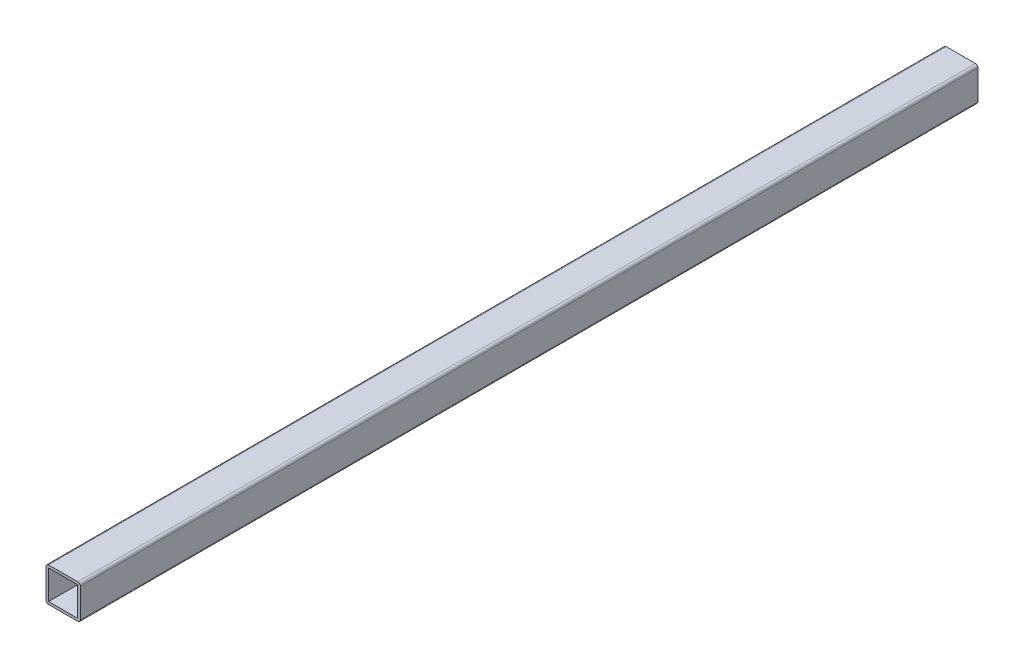
ISO-10303-21;
HEADER;
FILE_DESCRIPTION(('STEP AP214'),'2;1');
FILE_NAME('part.step','',(''),(''),'','','');
FILE_SCHEMA(('AUTOMOTIVE_DESIGN { 1 0 10303 214 1 1 1 1 }'));
ENDSEC;
DATA;
#1=APPLICATION_CONTEXT('core data for automotive mechanical design processes');
#2=APPLICATION_PROTOCOL_DEFINITION('international standard','automotive_design',2000,#1);
#3=PRODUCT_CONTEXT('',#1,'mechanical');
#4=PRODUCT('Part','Part','',(#3));
#5=PRODUCT_RELATED_PRODUCT_CATEGORY('part','',(#4));
#6=PRODUCT_DEFINITION_FORMATION('','',#4);
#7=PRODUCT_DEFINITION_CONTEXT('part definition',#1,'design');
#8=PRODUCT_DEFINITION('design','',#6,#7);
#9=PRODUCT_DEFINITION_SHAPE('','',#8);
#10=(LENGTH_UNIT() NAMED_UNIT(*) SI_UNIT(.MILLI.,.METRE.));
#11=(NAMED_UNIT(*) PLANE_ANGLE_UNIT() SI_UNIT($,.RADIAN.));
#12=(NAMED_UNIT(*) SI_UNIT($,.STERADIAN.) SOLID_ANGLE_UNIT());
#13=UNCERTAINTY_MEASURE_WITH_UNIT(LENGTH_MEASURE(1.E-05),#10,'distance_accuracy_value','');
#14=(GEOMETRIC_REPRESENTATION_CONTEXT(3) GLOBAL_UNCERTAINTY_ASSIGNED_CONTEXT((#13)) GLOBAL_UNIT_ASSIGNED_CONTEXT((#10,
#11,#12)) REPRESENTATION_CONTEXT('',''));
#15=CARTESIAN_POINT('',(0.,0.,0.));
#16=DIRECTION('',(0.,0.,1.));
#17=DIRECTION('',(1.,0.,0.));
#18=AXIS2_PLACEMENT_3D('',#15,#16,#17);
#19=CARTESIAN_POINT('',(-609.999999999993,609.999999999999,1103.56854249492));
#20=DIRECTION('',(1.,0.,0.));
#21=DIRECTION('',(0.,0.,-1.));
#22=AXIS2_PLACEMENT_3D('',#19,#20,#21);
#23=PLANE('',#22);
#24=DIRECTION('',(0.,-1.,0.));
#25=VECTOR('',#24,1.);
#26=CARTESIAN_POINT('',(-609.999999999993,609.999999999999,0.));
#27=LINE('',#26,#25);
#28=CARTESIAN_POINT('',(-609.999999999993,606.999999999999,0.));
#29=VERTEX_POINT('',#28);
#30=CARTESIAN_POINT('',(-609.999999999993,572.999999999999,0.));
#31=VERTEX_POINT('',#30);
#32=EDGE_CURVE('E185',#29,#31,#27,.T.);
#33=ORIENTED_EDGE('',*,*,#32,.T.);
#34=DIRECTION('',(0.,0.,-1.));
#35=VECTOR('',#34,1.);
#36=CARTESIAN_POINT('',(-609.999999999993,572.999999999999,1103.56854249492));
#37=LINE('',#36,#35);
#38=CARTESIAN_POINT('',(-609.999999999993,572.999999999999,1047.));
#39=VERTEX_POINT('',#38);
#40=EDGE_CURVE('E11',#31,#39,#37,.F.);
#41=ORIENTED_EDGE('',*,*,#40,.T.);
#42=DIRECTION('',(0.,-1.,0.));
#43=VECTOR('',#42,1.);
#44=CARTESIAN_POINT('',(-609.999999999993,609.999999999999,1047.));
#45=LINE('',#44,#43);
#46=CARTESIAN_POINT('',(-609.999999999993,606.999999999999,1047.));
#47=VERTEX_POINT('',#46);
#48=EDGE_CURVE('E166',#47,#39,#45,.T.);
#49=ORIENTED_EDGE('',*,*,#48,.F.);
#50=DIRECTION('',(0.,0.,-1.));
#51=VECTOR('',#50,1.);
#52=CARTESIAN_POINT('',(-609.999999999993,606.999999999999,1103.56854249492));
#53=LINE('',#52,#51);
#54=EDGE_CURVE('E46',#47,#29,#53,.T.);
#55=ORIENTED_EDGE('',*,*,#54,.T.);
#56=EDGE_LOOP('',(#33,#41,#49,#55));
#57=FACE_BOUND('',#56,.T.);
#58=ADVANCED_FACE('F37',(#57),#23,.F.);
#59=CARTESIAN_POINT('',(-609.999999999993,569.999999999999,1103.56854249492));
#60=DIRECTION('',(0.,1.,0.));
#61=DIRECTION('',(0.,0.,1.));
#62=AXIS2_PLACEMENT_3D('',#59,#60,#61);
#63=PLANE('',#62);
#64=DIRECTION('',(1.,0.,0.));
#65=VECTOR('',#64,1.);
#66=CARTESIAN_POINT('',(-609.999999999993,569.999999999999,0.));
#67=LINE('',#66,#65);
#68=CARTESIAN_POINT('',(-606.999999999993,569.999999999999,0.));
#69=VERTEX_POINT('',#68);
#70=CARTESIAN_POINT('',(-572.999999999999,569.999999999999,0.));
#71=VERTEX_POINT('',#70);
#72=EDGE_CURVE('E181',#69,#71,#67,.T.);
#73=ORIENTED_EDGE('',*,*,#72,.T.);
#74=DIRECTION('',(0.,0.,-1.));
#75=VECTOR('',#74,1.);
#76=CARTESIAN_POINT('',(-572.999999999999,569.999999999999,1103.56854249492));
#77=LINE('',#76,#75);
#78=CARTESIAN_POINT('',(-572.999999999999,569.999999999999,1047.));
#79=VERTEX_POINT('',#78);
#80=EDGE_CURVE('E222',#71,#79,#77,.F.);
#81=ORIENTED_EDGE('',*,*,#80,.T.);
#82=DIRECTION('',(1.,0.,0.));
#83=VECTOR('',#82,1.);
#84=CARTESIAN_POINT('',(-609.999999999993,569.999999999999,1047.));
#85=LINE('',#84,#83);
#86=CARTESIAN_POINT('',(-606.999999999993,569.999999999999,1047.));
#87=VERTEX_POINT('',#86);
#88=EDGE_CURVE('E176',#87,#79,#85,.T.);
#89=ORIENTED_EDGE('',*,*,#88,.F.);
#90=DIRECTION('',(0.,0.,-1.));
#91=VECTOR('',#90,1.);
#92=CARTESIAN_POINT('',(-606.999999999993,569.999999999999,1103.56854249492));
#93=LINE('',#92,#91);
#94=EDGE_CURVE('E218',#87,#69,#93,.T.);
#95=ORIENTED_EDGE('',*,*,#94,.T.);
#96=EDGE_LOOP('',(#73,#81,#89,#95));
#97=FACE_BOUND('',#96,.T.);
#98=ADVANCED_FACE('F261',(#97),#63,.F.);
#99=CARTESIAN_POINT('',(-569.999999999999,609.999999999999,1103.56854249492));
#100=DIRECTION('',(-1.,0.,0.));
#101=DIRECTION('',(0.,0.,1.));
#102=AXIS2_PLACEMENT_3D('',#99,#100,#101);
#103=PLANE('',#102);
#104=DIRECTION('',(0.,1.,0.));
#105=VECTOR('',#104,1.);
#106=CARTESIAN_POINT('',(-569.999999999999,609.999999999999,1047.));
#107=LINE('',#106,#105);
#108=CARTESIAN_POINT('',(-569.999999999999,572.999999999999,1047.));
#109=VERTEX_POINT('',#108);
#110=CARTESIAN_POINT('',(-569.999999999999,606.999999999999,1047.));
#111=VERTEX_POINT('',#110);
#112=EDGE_CURVE('E193',#109,#111,#107,.T.);
#113=ORIENTED_EDGE('',*,*,#112,.F.);
#114=DIRECTION('',(0.,0.,-1.));
#115=VECTOR('',#114,1.);
#116=CARTESIAN_POINT('',(-569.999999999999,572.999999999999,1103.56854249492));
#117=LINE('',#116,#115);
#118=CARTESIAN_POINT('',(-569.999999999999,572.999999999999,0.));
#119=VERTEX_POINT('',#118);
#120=EDGE_CURVE('E202',#109,#119,#117,.T.);
#121=ORIENTED_EDGE('',*,*,#120,.T.);
#122=DIRECTION('',(0.,1.,0.));
#123=VECTOR('',#122,1.);
#124=CARTESIAN_POINT('',(-569.999999999999,609.999999999999,0.));
#125=LINE('',#124,#123);
#126=CARTESIAN_POINT('',(-569.999999999999,606.999999999999,0.));
#127=VERTEX_POINT('',#126);
#128=EDGE_CURVE('E177',#119,#127,#125,.T.);
#129=ORIENTED_EDGE('',*,*,#128,.T.);
#130=DIRECTION('',(0.,0.,-1.));
#131=VECTOR('',#130,1.);
#132=CARTESIAN_POINT('',(-569.999999999999,606.999999999999,1103.56854249492));
#133=LINE('',#132,#131);
#134=EDGE_CURVE('E170',#127,#111,#133,.F.);
#135=ORIENTED_EDGE('',*,*,#134,.T.);
#136=EDGE_LOOP('',(#113,#121,#129,#135));
#137=FACE_BOUND('',#136,.T.);
#138=ADVANCED_FACE('F271',(#137),#103,.F.);
#139=CARTESIAN_POINT('',(-609.999999999993,609.999999999999,1103.56854249492));
#140=DIRECTION('',(0.,-1.,0.));
#141=DIRECTION('',(0.,0.,-1.));
#142=AXIS2_PLACEMENT_3D('',#139,#140,#141);
#143=PLANE('',#142);
#144=DIRECTION('',(-1.,0.,0.));
#145=VECTOR('',#144,1.);
#146=CARTESIAN_POINT('',(-609.999999999993,609.999999999999,1047.));
#147=LINE('',#146,#145);
#148=CARTESIAN_POINT('',(-572.999999999999,609.999999999999,1047.));
#149=VERTEX_POINT('',#148);
#150=CARTESIAN_POINT('',(-606.999999999993,609.999999999999,1047.));
#151=VERTEX_POINT('',#150);
#152=EDGE_CURVE('E171',#149,#151,#147,.T.);
#153=ORIENTED_EDGE('',*,*,#152,.F.);
#154=DIRECTION('',(0.,0.,-1.));
#155=VECTOR('',#154,1.);
#156=CARTESIAN_POINT('',(-572.999999999999,609.999999999999,1103.56854249492));
#157=LINE('',#156,#155);
#158=CARTESIAN_POINT('',(-572.999999999999,609.999999999999,0.));
#159=VERTEX_POINT('',#158);
#160=EDGE_CURVE('E240',#149,#159,#157,.T.);
#161=ORIENTED_EDGE('',*,*,#160,.T.);
#162=DIRECTION('',(-1.,0.,0.));
#163=VECTOR('',#162,1.);
#164=CARTESIAN_POINT('',(-609.999999999993,609.999999999999,0.));
#165=LINE('',#164,#163);
#166=CARTESIAN_POINT('',(-606.999999999993,609.999999999999,0.));
#167=VERTEX_POINT('',#166);
#168=EDGE_CURVE('E172',#159,#167,#165,.T.);
#169=ORIENTED_EDGE('',*,*,#168,.T.);
#170=DIRECTION('',(0.,0.,-1.));
#171=VECTOR('',#170,1.);
#172=CARTESIAN_POINT('',(-606.999999999993,609.999999999999,1103.56854249492));
#173=LINE('',#172,#171);
#174=EDGE_CURVE('E237',#167,#151,#173,.F.);
#175=ORIENTED_EDGE('',*,*,#174,.T.);
#176=EDGE_LOOP('',(#153,#161,#169,#175));
#177=FACE_BOUND('',#176,.T.);
#178=ADVANCED_FACE('F279',(#177),#143,.F.);
#179=CARTESIAN_POINT('',(0.,0.,0.));
#180=DIRECTION('',(0.,0.,1.));
#181=DIRECTION('',(1.,0.,0.));
#182=AXIS2_PLACEMENT_3D('',#179,#180,#181);
#183=PLANE('',#182);
#184=DIRECTION('',(1.,0.,0.));
#185=VECTOR('',#184,1.);
#186=CARTESIAN_POINT('',(-609.999999999993,572.999999999999,0.));
#187=LINE('',#186,#185);
#188=CARTESIAN_POINT('',(-606.999999999993,572.999999999999,0.));
#189=VERTEX_POINT('',#188);
#190=CARTESIAN_POINT('',(-572.999999999999,572.999999999999,0.));
#191=VERTEX_POINT('',#190);
#192=EDGE_CURVE('E149',#189,#191,#187,.T.);
#193=ORIENTED_EDGE('',*,*,#192,.T.);
#194=DIRECTION('',(0.,1.,0.));
#195=VECTOR('',#194,1.);
#196=CARTESIAN_POINT('',(-572.999999999999,609.999999999999,0.));
#197=LINE('',#196,#195);
#198=CARTESIAN_POINT('',(-572.999999999999,606.999999999999,0.));
#199=VERTEX_POINT('',#198);
#200=EDGE_CURVE('E130',#191,#199,#197,.T.);
#201=ORIENTED_EDGE('',*,*,#200,.T.);
#202=DIRECTION('',(-1.,0.,0.));
#203=VECTOR('',#202,1.);
#204=CARTESIAN_POINT('',(-609.999999999993,606.999999999999,0.));
#205=LINE('',#204,#203);
#206=CARTESIAN_POINT('',(-606.999999999993,606.999999999999,0.));
#207=VERTEX_POINT('',#206);
#208=EDGE_CURVE('E139',#199,#207,#205,.T.);
#209=ORIENTED_EDGE('',*,*,#208,.T.);
#210=DIRECTION('',(0.,-1.,0.));
#211=VECTOR('',#210,1.);
#212=CARTESIAN_POINT('',(-606.999999999993,609.999999999999,0.));
#213=LINE('',#212,#211);
#214=EDGE_CURVE('E53',#207,#189,#213,.T.);
#215=ORIENTED_EDGE('',*,*,#214,.T.);
#216=EDGE_LOOP('',(#193,#201,#209,#215));
#217=FACE_BOUND('',#216,.T.);
#218=ORIENTED_EDGE('',*,*,#128,.F.);
#219=CARTESIAN_POINT('',(-572.999999999999,572.999999999999,0.));
#220=DIRECTION('',(0.,0.,1.));
#221=DIRECTION('',(1.,0.,0.));
#222=AXIS2_PLACEMENT_3D('',#219,#220,#221);
#223=CIRCLE('',#222,3.);
#224=EDGE_CURVE('E215',#119,#71,#223,.F.);
#225=ORIENTED_EDGE('',*,*,#224,.T.);
#226=ORIENTED_EDGE('',*,*,#72,.F.);
#227=CARTESIAN_POINT('',(-606.999999999993,572.999999999999,0.));
#228=DIRECTION('',(0.,0.,1.));
#229=DIRECTION('',(1.,0.,0.));
#230=AXIS2_PLACEMENT_3D('',#227,#228,#229);
#231=CIRCLE('',#230,3.);
#232=EDGE_CURVE('E209',#69,#31,#231,.F.);
#233=ORIENTED_EDGE('',*,*,#232,.T.);
#234=ORIENTED_EDGE('',*,*,#32,.F.);
#235=CARTESIAN_POINT('',(-606.999999999993,606.999999999999,0.));
#236=DIRECTION('',(0.,0.,1.));
#237=DIRECTION('',(1.,0.,0.));
#238=AXIS2_PLACEMENT_3D('',#235,#236,#237);
#239=CIRCLE('',#238,3.);
#240=EDGE_CURVE('E206',#29,#167,#239,.F.);
#241=ORIENTED_EDGE('',*,*,#240,.T.);
#242=ORIENTED_EDGE('',*,*,#168,.F.);
#243=CARTESIAN_POINT('',(-572.999999999999,606.999999999999,0.));
#244=DIRECTION('',(0.,0.,1.));
#245=DIRECTION('',(1.,0.,0.));
#246=AXIS2_PLACEMENT_3D('',#243,#244,#245);
#247=CIRCLE('',#246,3.);
#248=EDGE_CURVE('E212',#159,#127,#247,.F.);
#249=ORIENTED_EDGE('',*,*,#248,.T.);
#250=EDGE_LOOP('',(#218,#225,#226,#233,#234,#241,#242,#249));
#251=FACE_BOUND('',#250,.T.);
#252=ADVANCED_FACE('F146',(#217,#251),#183,.F.);
#253=CARTESIAN_POINT('',(0.,0.,1047.));
#254=DIRECTION('',(0.,0.,1.));
#255=DIRECTION('',(0.,-1.,0.));
#256=AXIS2_PLACEMENT_3D('',#253,#254,#255);
#257=PLANE('',#256);
#258=DIRECTION('',(1.,0.,0.));
#259=VECTOR('',#258,1.);
#260=CARTESIAN_POINT('',(-609.999999999993,572.999999999999,1047.));
#261=LINE('',#260,#259);
#262=CARTESIAN_POINT('',(-606.999999999993,572.999999999999,1047.));
#263=VERTEX_POINT('',#262);
#264=CARTESIAN_POINT('',(-572.999999999999,572.999999999999,1047.));
#265=VERTEX_POINT('',#264);
#266=EDGE_CURVE('E144',#263,#265,#261,.T.);
#267=ORIENTED_EDGE('',*,*,#266,.F.);
#268=DIRECTION('',(0.,-1.,0.));
#269=VECTOR('',#268,1.);
#270=CARTESIAN_POINT('',(-606.999999999993,609.999999999999,1047.));
#271=LINE('',#270,#269);
#272=CARTESIAN_POINT('',(-606.999999999993,606.999999999999,1047.));
#273=VERTEX_POINT('',#272);
#274=EDGE_CURVE('E136',#273,#263,#271,.T.);
#275=ORIENTED_EDGE('',*,*,#274,.F.);
#276=DIRECTION('',(-1.,0.,0.));
#277=VECTOR('',#276,1.);
#278=CARTESIAN_POINT('',(-609.999999999993,606.999999999999,1047.));
#279=LINE('',#278,#277);
#280=CARTESIAN_POINT('',(-572.999999999999,606.999999999999,1047.));
#281=VERTEX_POINT('',#280);
#282=EDGE_CURVE('E60',#281,#273,#279,.T.);
#283=ORIENTED_EDGE('',*,*,#282,.F.);
#284=DIRECTION('',(0.,1.,0.));
#285=VECTOR('',#284,1.);
#286=CARTESIAN_POINT('',(-572.999999999999,609.999999999999,1047.));
#287=LINE('',#286,#285);
#288=EDGE_CURVE('E133',#265,#281,#287,.T.);
#289=ORIENTED_EDGE('',*,*,#288,.F.);
#290=EDGE_LOOP('',(#267,#275,#283,#289));
#291=FACE_BOUND('',#290,.T.);
#292=ORIENTED_EDGE('',*,*,#88,.T.);
#293=CARTESIAN_POINT('',(-572.999999999999,572.999999999999,1047.));
#294=DIRECTION('',(0.,0.,1.));
#295=DIRECTION('',(1.,0.,0.));
#296=AXIS2_PLACEMENT_3D('',#293,#294,#295);
#297=CIRCLE('',#296,3.);
#298=EDGE_CURVE('E234',#79,#109,#297,.T.);
#299=ORIENTED_EDGE('',*,*,#298,.T.);
#300=ORIENTED_EDGE('',*,*,#112,.T.);
#301=CARTESIAN_POINT('',(-572.999999999999,606.999999999999,1047.));
#302=DIRECTION('',(0.,0.,1.));
#303=DIRECTION('',(1.,0.,0.));
#304=AXIS2_PLACEMENT_3D('',#301,#302,#303);
#305=CIRCLE('',#304,3.);
#306=EDGE_CURVE('E231',#111,#149,#305,.T.);
#307=ORIENTED_EDGE('',*,*,#306,.T.);
#308=ORIENTED_EDGE('',*,*,#152,.T.);
#309=CARTESIAN_POINT('',(-606.999999999993,606.999999999999,1047.));
#310=DIRECTION('',(0.,0.,1.));
#311=DIRECTION('',(1.,0.,0.));
#312=AXIS2_PLACEMENT_3D('',#309,#310,#311);
#313=CIRCLE('',#312,3.);
#314=EDGE_CURVE('E225',#151,#47,#313,.T.);
#315=ORIENTED_EDGE('',*,*,#314,.T.);
#316=ORIENTED_EDGE('',*,*,#48,.T.);
#317=CARTESIAN_POINT('',(-606.999999999993,572.999999999999,1047.));
#318=DIRECTION('',(0.,0.,1.));
#319=DIRECTION('',(1.,0.,0.));
#320=AXIS2_PLACEMENT_3D('',#317,#318,#319);
#321=CIRCLE('',#320,3.);
#322=EDGE_CURVE('E228',#39,#87,#321,.T.);
#323=ORIENTED_EDGE('',*,*,#322,.T.);
#324=EDGE_LOOP('',(#292,#299,#300,#307,#308,#315,#316,#323));
#325=FACE_BOUND('',#324,.T.);
#326=ADVANCED_FACE('F265',(#291,#325),#257,.T.);
#327=CARTESIAN_POINT('',(-572.999999999999,572.999999999999,1103.56854249492));
#328=DIRECTION('',(0.,0.,-1.));
#329=DIRECTION('',(-1.,0.,0.));
#330=AXIS2_PLACEMENT_3D('',#327,#328,#329);
#331=CYLINDRICAL_SURFACE('',#330,3.);
#332=ORIENTED_EDGE('',*,*,#298,.F.);
#333=ORIENTED_EDGE('',*,*,#80,.F.);
#334=ORIENTED_EDGE('',*,*,#224,.F.);
#335=ORIENTED_EDGE('',*,*,#120,.F.);
#336=EDGE_LOOP('',(#332,#333,#334,#335));
#337=FACE_BOUND('',#336,.T.);
#338=ADVANCED_FACE('F269',(#337),#331,.T.);
#339=CARTESIAN_POINT('',(-572.999999999999,606.999999999999,1103.56854249492));
#340=DIRECTION('',(0.,0.,-1.));
#341=DIRECTION('',(-1.,0.,0.));
#342=AXIS2_PLACEMENT_3D('',#339,#340,#341);
#343=CYLINDRICAL_SURFACE('',#342,3.);
#344=ORIENTED_EDGE('',*,*,#306,.F.);
#345=ORIENTED_EDGE('',*,*,#134,.F.);
#346=ORIENTED_EDGE('',*,*,#248,.F.);
#347=ORIENTED_EDGE('',*,*,#160,.F.);
#348=EDGE_LOOP('',(#344,#345,#346,#347));
#349=FACE_BOUND('',#348,.T.);
#350=ADVANCED_FACE('F276',(#349),#343,.T.);
#351=CARTESIAN_POINT('',(-606.999999999993,572.999999999999,1103.56854249492));
#352=DIRECTION('',(0.,0.,-1.));
#353=DIRECTION('',(-1.,0.,0.));
#354=AXIS2_PLACEMENT_3D('',#351,#352,#353);
#355=CYLINDRICAL_SURFACE('',#354,3.);
#356=ORIENTED_EDGE('',*,*,#322,.F.);
#357=ORIENTED_EDGE('',*,*,#40,.F.);
#358=ORIENTED_EDGE('',*,*,#232,.F.);
#359=ORIENTED_EDGE('',*,*,#94,.F.);
#360=EDGE_LOOP('',(#356,#357,#358,#359));
#361=FACE_BOUND('',#360,.T.);
#362=ADVANCED_FACE('F258',(#361),#355,.T.);
#363=CARTESIAN_POINT('',(-606.999999999993,606.999999999999,1103.56854249492));
#364=DIRECTION('',(0.,0.,-1.));
#365=DIRECTION('',(-1.,0.,0.));
#366=AXIS2_PLACEMENT_3D('',#363,#364,#365);
#367=CYLINDRICAL_SURFACE('',#366,3.);
#368=ORIENTED_EDGE('',*,*,#314,.F.);
#369=ORIENTED_EDGE('',*,*,#174,.F.);
#370=ORIENTED_EDGE('',*,*,#240,.F.);
#371=ORIENTED_EDGE('',*,*,#54,.F.);
#372=EDGE_LOOP('',(#368,#369,#370,#371));
#373=FACE_BOUND('',#372,.T.);
#374=ADVANCED_FACE('F39',(#373),#367,.T.);
#375=CARTESIAN_POINT('',(-606.999999999993,609.999999999999,1103.56854249492));
#376=DIRECTION('',(1.,0.,0.));
#377=DIRECTION('',(0.,0.,-1.));
#378=AXIS2_PLACEMENT_3D('',#375,#376,#377);
#379=PLANE('',#378);
#380=ORIENTED_EDGE('',*,*,#214,.F.);
#381=DIRECTION('',(0.,0.,1.));
#382=VECTOR('',#381,1.);
#383=CARTESIAN_POINT('',(-606.999999999993,606.999999999999,1103.56854249492));
#384=LINE('',#383,#382);
#385=EDGE_CURVE('E141',#207,#273,#384,.T.);
#386=ORIENTED_EDGE('',*,*,#385,.T.);
#387=ORIENTED_EDGE('',*,*,#274,.T.);
#388=DIRECTION('',(0.,0.,1.));
#389=VECTOR('',#388,1.);
#390=CARTESIAN_POINT('',(-606.999999999993,572.999999999999,1103.56854249492));
#391=LINE('',#390,#389);
#392=EDGE_CURVE('E189',#189,#263,#391,.T.);
#393=ORIENTED_EDGE('',*,*,#392,.F.);
#394=EDGE_LOOP('',(#380,#386,#387,#393));
#395=FACE_BOUND('',#394,.T.);
#396=ADVANCED_FACE('F282',(#395),#379,.T.);
#397=CARTESIAN_POINT('',(-609.999999999993,572.999999999999,1103.56854249492));
#398=DIRECTION('',(0.,1.,0.));
#399=DIRECTION('',(0.,0.,1.));
#400=AXIS2_PLACEMENT_3D('',#397,#398,#399);
#401=PLANE('',#400);
#402=ORIENTED_EDGE('',*,*,#192,.F.);
#403=ORIENTED_EDGE('',*,*,#392,.T.);
#404=ORIENTED_EDGE('',*,*,#266,.T.);
#405=DIRECTION('',(0.,0.,1.));
#406=VECTOR('',#405,1.);
#407=CARTESIAN_POINT('',(-572.999999999999,572.999999999999,1103.56854249492));
#408=LINE('',#407,#406);
#409=EDGE_CURVE('E135',#191,#265,#408,.T.);
#410=ORIENTED_EDGE('',*,*,#409,.F.);
#411=EDGE_LOOP('',(#402,#403,#404,#410));
#412=FACE_BOUND('',#411,.T.);
#413=ADVANCED_FACE('F287',(#412),#401,.T.);
#414=CARTESIAN_POINT('',(-572.999999999999,609.999999999999,1103.56854249492));
#415=DIRECTION('',(-1.,0.,0.));
#416=DIRECTION('',(0.,0.,1.));
#417=AXIS2_PLACEMENT_3D('',#414,#415,#416);
#418=PLANE('',#417);
#419=ORIENTED_EDGE('',*,*,#288,.T.);
#420=DIRECTION('',(0.,0.,1.));
#421=VECTOR('',#420,1.);
#422=CARTESIAN_POINT('',(-572.999999999999,606.999999999999,1103.56854249492));
#423=LINE('',#422,#421);
#424=EDGE_CURVE('E126',#199,#281,#423,.T.);
#425=ORIENTED_EDGE('',*,*,#424,.F.);
#426=ORIENTED_EDGE('',*,*,#200,.F.);
#427=ORIENTED_EDGE('',*,*,#409,.T.);
#428=EDGE_LOOP('',(#419,#425,#426,#427));
#429=FACE_BOUND('',#428,.T.);
#430=ADVANCED_FACE('F128',(#429),#418,.T.);
#431=CARTESIAN_POINT('',(-609.999999999993,606.999999999999,1103.56854249492));
#432=DIRECTION('',(0.,-1.,0.));
#433=DIRECTION('',(0.,0.,-1.));
#434=AXIS2_PLACEMENT_3D('',#431,#432,#433);
#435=PLANE('',#434);
#436=ORIENTED_EDGE('',*,*,#282,.T.);
#437=ORIENTED_EDGE('',*,*,#385,.F.);
#438=ORIENTED_EDGE('',*,*,#208,.F.);
#439=ORIENTED_EDGE('',*,*,#424,.T.);
#440=EDGE_LOOP('',(#436,#437,#438,#439));
#441=FACE_BOUND('',#440,.T.);
#442=ADVANCED_FACE('F140',(#441),#435,.T.);
#443=CLOSED_SHELL('',(#58,#98,#138,#178,#252,#326,#338,#350,#362,#374,#396,#413,#430,#442));
#444=MANIFOLD_SOLID_BREP('B2',#443);
#445=ADVANCED_BREP_SHAPE_REPRESENTATION('',(#18,#444),#14);
#446=SHAPE_DEFINITION_REPRESENTATION(#9,#445);
ENDSEC;
END-ISO-10303-21;
